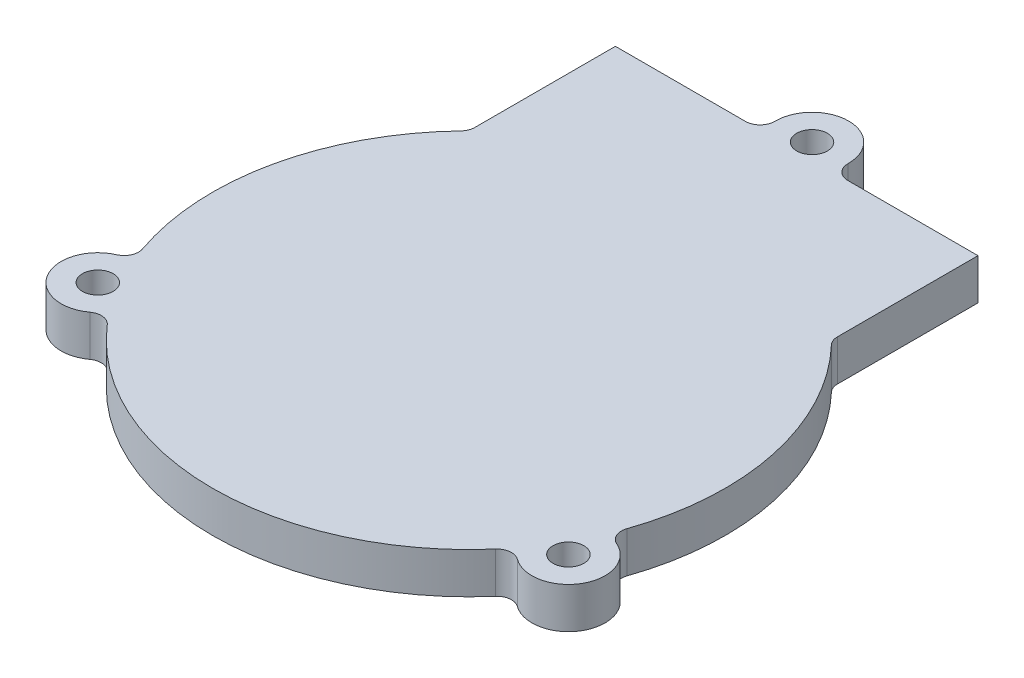
ISO-10303-21;
HEADER;
FILE_DESCRIPTION(('STEP AP214'),'2;1');
FILE_NAME('part.step','',(''),(''),'','','');
FILE_SCHEMA(('AUTOMOTIVE_DESIGN { 1 0 10303 214 1 1 1 1 }'));
ENDSEC;
DATA;
#1=APPLICATION_CONTEXT('core data for automotive mechanical design processes');
#2=APPLICATION_PROTOCOL_DEFINITION('international standard','automotive_design',2000,#1);
#3=PRODUCT_CONTEXT('',#1,'mechanical');
#4=PRODUCT('Part','Part','',(#3));
#5=PRODUCT_RELATED_PRODUCT_CATEGORY('part','',(#4));
#6=PRODUCT_DEFINITION_FORMATION('','',#4);
#7=PRODUCT_DEFINITION_CONTEXT('part definition',#1,'design');
#8=PRODUCT_DEFINITION('design','',#6,#7);
#9=PRODUCT_DEFINITION_SHAPE('','',#8);
#10=(LENGTH_UNIT() NAMED_UNIT(*) SI_UNIT(.MILLI.,.METRE.));
#11=(NAMED_UNIT(*) PLANE_ANGLE_UNIT() SI_UNIT($,.RADIAN.));
#12=(NAMED_UNIT(*) SI_UNIT($,.STERADIAN.) SOLID_ANGLE_UNIT());
#13=UNCERTAINTY_MEASURE_WITH_UNIT(LENGTH_MEASURE(1.E-05),#10,'distance_accuracy_value','');
#14=(GEOMETRIC_REPRESENTATION_CONTEXT(3) GLOBAL_UNCERTAINTY_ASSIGNED_CONTEXT((#13)) GLOBAL_UNIT_ASSIGNED_CONTEXT((#10,
#11,#12)) REPRESENTATION_CONTEXT('',''));
#15=CARTESIAN_POINT('',(0.,0.,0.));
#16=DIRECTION('',(0.,0.,1.));
#17=DIRECTION('',(1.,0.,0.));
#18=AXIS2_PLACEMENT_3D('',#15,#16,#17);
#19=CARTESIAN_POINT('',(0.,5.588,0.));
#20=DIRECTION('',(0.,-1.,0.));
#21=DIRECTION('',(0.,0.,-1.));
#22=AXIS2_PLACEMENT_3D('',#19,#20,#21);
#23=CYLINDRICAL_SURFACE('',#22,35.);
#24=CARTESIAN_POINT('',(0.,0.,0.));
#25=DIRECTION('',(0.,1.,0.));
#26=DIRECTION('',(0.,0.,1.));
#27=AXIS2_PLACEMENT_3D('',#24,#25,#26);
#28=CIRCLE('',#27,35.);
#29=CARTESIAN_POINT('',(-25.3019754085747,0.,-24.1828459951239));
#30=VERTEX_POINT('',#29);
#31=CARTESIAN_POINT('',(-33.072840065109,0.,11.4537002766671));
#32=VERTEX_POINT('',#31);
#33=EDGE_CURVE('E212',#30,#32,#28,.T.);
#34=ORIENTED_EDGE('',*,*,#33,.T.);
#35=DIRECTION('',(0.,-1.,0.));
#36=VECTOR('',#35,1.);
#37=CARTESIAN_POINT('',(-33.072840065109,5.588,11.4537002766671));
#38=LINE('',#37,#36);
#39=CARTESIAN_POINT('',(-33.072840065109,5.588,11.4537002766671));
#40=VERTEX_POINT('',#39);
#41=EDGE_CURVE('E225',#32,#40,#38,.F.);
#42=ORIENTED_EDGE('',*,*,#41,.T.);
#43=CARTESIAN_POINT('',(0.,5.588,0.));
#44=DIRECTION('',(0.,1.,0.));
#45=DIRECTION('',(0.,0.,1.));
#46=AXIS2_PLACEMENT_3D('',#43,#44,#45);
#47=CIRCLE('',#46,35.);
#48=CARTESIAN_POINT('',(-25.3019754085747,5.588,-24.1828459951239));
#49=VERTEX_POINT('',#48);
#50=EDGE_CURVE('E206',#49,#40,#47,.T.);
#51=ORIENTED_EDGE('',*,*,#50,.F.);
#52=DIRECTION('',(0.,-1.,0.));
#53=VECTOR('',#52,1.);
#54=CARTESIAN_POINT('',(-25.3019754085747,5.588,-24.1828459951239));
#55=LINE('',#54,#53);
#56=EDGE_CURVE('E219',#49,#30,#55,.T.);
#57=ORIENTED_EDGE('',*,*,#56,.T.);
#58=EDGE_LOOP('',(#34,#42,#51,#57));
#59=FACE_BOUND('',#58,.T.);
#60=ADVANCED_FACE('F43',(#59),#23,.T.);
#61=CARTESIAN_POINT('',(-26.5021889393046,0.,22.8611894140572));
#62=VERTEX_POINT('',#61);
#63=CARTESIAN_POINT('',(26.4887144081727,0.,22.8768006723464));
#64=VERTEX_POINT('',#63);
#65=EDGE_CURVE('E215',#62,#64,#28,.T.);
#66=ORIENTED_EDGE('',*,*,#65,.T.);
#67=DIRECTION('',(0.,-1.,0.));
#68=VECTOR('',#67,1.);
#69=CARTESIAN_POINT('',(26.4887144081727,5.588,22.8768006723464));
#70=LINE('',#69,#68);
#71=CARTESIAN_POINT('',(26.4887144081727,5.588,22.8768006723464));
#72=VERTEX_POINT('',#71);
#73=EDGE_CURVE('E244',#64,#72,#70,.F.);
#74=ORIENTED_EDGE('',*,*,#73,.T.);
#75=CARTESIAN_POINT('',(-26.5021889393046,5.588,22.8611894140572));
#76=VERTEX_POINT('',#75);
#77=EDGE_CURVE('E210',#76,#72,#47,.T.);
#78=ORIENTED_EDGE('',*,*,#77,.F.);
#79=DIRECTION('',(0.,-1.,0.));
#80=VECTOR('',#79,1.);
#81=CARTESIAN_POINT('',(-26.5021889393046,5.588,22.8611894140572));
#82=LINE('',#81,#80);
#83=EDGE_CURVE('E235',#76,#62,#82,.T.);
#84=ORIENTED_EDGE('',*,*,#83,.T.);
#85=EDGE_LOOP('',(#66,#74,#78,#84));
#86=FACE_BOUND('',#85,.T.);
#87=ADVANCED_FACE('F346',(#86),#23,.T.);
#88=CARTESIAN_POINT('',(-24.7478605121482,-53.381962685779,-44.7452325826062));
#89=DIRECTION('',(3.0206381024394E-06,0.,0.999999999995438));
#90=DIRECTION('',(0.999999999995438,0.,-3.0206381024394E-06));
#91=AXIS2_PLACEMENT_3D('',#88,#89,#90);
#92=PLANE('',#91);
#93=DIRECTION('',(0.999999999995438,0.,-3.0206381024394E-06));
#94=VECTOR('',#93,1.);
#95=CARTESIAN_POINT('',(-24.7478605121482,5.588,-44.7452325826062));
#96=LINE('',#95,#94);
#97=CARTESIAN_POINT('',(-24.7478605121482,5.588,-44.7452325826062));
#98=VERTEX_POINT('',#97);
#99=CARTESIAN_POINT('',(-6.99532394188785,5.588,-44.7452862065945));
#100=VERTEX_POINT('',#99);
#101=EDGE_CURVE('E178',#98,#100,#96,.T.);
#102=ORIENTED_EDGE('',*,*,#101,.T.);
#103=DIRECTION('',(0.,1.,0.));
#104=VECTOR('',#103,1.);
#105=CARTESIAN_POINT('',(-6.99532394188785,-53.381962685779,-44.7452862065945));
#106=LINE('',#105,#104);
#107=CARTESIAN_POINT('',(-6.99532394188785,0.,-44.7452862065945));
#108=VERTEX_POINT('',#107);
#109=EDGE_CURVE('E278',#100,#108,#106,.F.);
#110=ORIENTED_EDGE('',*,*,#109,.T.);
#111=DIRECTION('',(-0.999999999995438,0.,3.0206381024394E-06));
#112=VECTOR('',#111,1.);
#113=CARTESIAN_POINT('',(-24.7478605121482,0.,-44.7452325826062));
#114=LINE('',#113,#112);
#115=CARTESIAN_POINT('',(-24.7478605121482,0.,-44.7452325826062));
#116=VERTEX_POINT('',#115);
#117=EDGE_CURVE('E199',#108,#116,#114,.T.);
#118=ORIENTED_EDGE('',*,*,#117,.T.);
#119=DIRECTION('',(0.,1.,0.));
#120=VECTOR('',#119,1.);
#121=CARTESIAN_POINT('',(-24.7478605121482,-53.381962685779,-44.7452325826062));
#122=LINE('',#121,#120);
#123=EDGE_CURVE('E195',#116,#98,#122,.T.);
#124=ORIENTED_EDGE('',*,*,#123,.T.);
#125=EDGE_LOOP('',(#102,#110,#118,#124));
#126=FACE_BOUND('',#125,.T.);
#127=ADVANCED_FACE('F284',(#126),#92,.F.);
#128=CARTESIAN_POINT('',(33.0630730181294,0.,11.4818640733046));
#129=VERTEX_POINT('',#128);
#130=CARTESIAN_POINT('',(25.3018293128609,0.,-24.1829988509046));
#131=VERTEX_POINT('',#130);
#132=EDGE_CURVE('E216',#129,#131,#28,.T.);
#133=ORIENTED_EDGE('',*,*,#132,.T.);
#134=DIRECTION('',(0.,-1.,0.));
#135=VECTOR('',#134,1.);
#136=CARTESIAN_POINT('',(25.3018293128609,5.588,-24.1829988509046));
#137=LINE('',#136,#135);
#138=CARTESIAN_POINT('',(25.3018293128609,5.588,-24.1829988509046));
#139=VERTEX_POINT('',#138);
#140=EDGE_CURVE('E263',#131,#139,#137,.F.);
#141=ORIENTED_EDGE('',*,*,#140,.T.);
#142=CARTESIAN_POINT('',(33.0630730181294,5.588,11.4818640733046));
#143=VERTEX_POINT('',#142);
#144=EDGE_CURVE('E211',#143,#139,#47,.T.);
#145=ORIENTED_EDGE('',*,*,#144,.F.);
#146=DIRECTION('',(0.,-1.,0.));
#147=VECTOR('',#146,1.);
#148=CARTESIAN_POINT('',(33.0630730181294,5.588,11.4818640733046));
#149=LINE('',#148,#147);
#150=EDGE_CURVE('E254',#143,#129,#149,.T.);
#151=ORIENTED_EDGE('',*,*,#150,.T.);
#152=EDGE_LOOP('',(#133,#141,#145,#151));
#153=FACE_BOUND('',#152,.T.);
#154=ADVANCED_FACE('F336',(#153),#23,.T.);
#155=CARTESIAN_POINT('',(0.,5.588,0.));
#156=DIRECTION('',(0.,1.,0.));
#157=DIRECTION('',(0.,0.,1.));
#158=AXIS2_PLACEMENT_3D('',#155,#156,#157);
#159=PLANE('',#158);
#160=CARTESIAN_POINT('',(-32.1480166138315,5.588,18.5087961651664));
#161=DIRECTION('',(0.,1.,0.));
#162=DIRECTION('',(0.,0.,1.));
#163=AXIS2_PLACEMENT_3D('',#160,#161,#162);
#164=CIRCLE('',#163,2.09999999999999);
#165=CARTESIAN_POINT('',(-32.1480166138315,5.588,20.6087961651664));
#166=VERTEX_POINT('',#165);
#167=EDGE_CURVE('E329',#166,#166,#164,.T.);
#168=ORIENTED_EDGE('',*,*,#167,.F.);
#169=EDGE_LOOP('',(#168));
#170=FACE_BOUND('',#169,.T.);
#171=DIRECTION('',(-3.02063810260161E-06,0.,-0.999999999995438));
#172=VECTOR('',#171,1.);
#173=CARTESIAN_POINT('',(-24.7478001128037,5.588,-24.7496745347634));
#174=LINE('',#173,#172);
#175=CARTESIAN_POINT('',(-24.7478025747881,5.588,-25.5647289504072));
#176=VERTEX_POINT('',#175);
#177=EDGE_CURVE('E196',#176,#98,#174,.T.);
#178=ORIENTED_EDGE('',*,*,#177,.F.);
#179=CARTESIAN_POINT('',(-26.747802574779,5.588,-25.564722909131));
#180=DIRECTION('',(0.,1.,0.));
#181=DIRECTION('',(0.,0.,1.));
#182=AXIS2_PLACEMENT_3D('',#179,#180,#181);
#183=CIRCLE('',#182,2.);
#184=EDGE_CURVE('E221',#176,#49,#183,.F.);
#185=ORIENTED_EDGE('',*,*,#184,.T.);
#186=ORIENTED_EDGE('',*,*,#50,.T.);
#187=CARTESIAN_POINT('',(-34.9627166402581,5.588,12.1081974353338));
#188=DIRECTION('',(0.,1.,0.));
#189=DIRECTION('',(0.,0.,1.));
#190=AXIS2_PLACEMENT_3D('',#187,#188,#189);
#191=CIRCLE('',#190,2.);
#192=CARTESIAN_POINT('',(-34.1580179965192,5.588,13.9391698799011));
#193=VERTEX_POINT('',#192);
#194=EDGE_CURVE('E231',#40,#193,#191,.F.);
#195=ORIENTED_EDGE('',*,*,#194,.T.);
#196=CARTESIAN_POINT('',(-32.1464555555357,5.588,18.5161819435163));
#197=DIRECTION('',(0.,1.,0.));
#198=DIRECTION('',(0.,0.,1.));
#199=AXIS2_PLACEMENT_3D('',#196,#197,#198);
#200=CIRCLE('',#199,4.99954226749351);
#201=CARTESIAN_POINT('',(-29.1966357044392,5.588,22.5527628891349));
#202=VERTEX_POINT('',#201);
#203=EDGE_CURVE('E323',#193,#202,#200,.T.);
#204=ORIENTED_EDGE('',*,*,#203,.T.);
#205=CARTESIAN_POINT('',(-28.0165997358363,5.588,24.1675430948605));
#206=DIRECTION('',(0.,1.,0.));
#207=DIRECTION('',(0.,0.,1.));
#208=AXIS2_PLACEMENT_3D('',#205,#206,#207);
#209=CIRCLE('',#208,2.);
#210=EDGE_CURVE('E242',#202,#76,#209,.F.);
#211=ORIENTED_EDGE('',*,*,#210,.T.);
#212=ORIENTED_EDGE('',*,*,#77,.T.);
#213=CARTESIAN_POINT('',(28.0023552314968,5.588,24.1840464250519));
#214=DIRECTION('',(0.,1.,0.));
#215=DIRECTION('',(0.,0.,1.));
#216=AXIS2_PLACEMENT_3D('',#213,#214,#215);
#217=CIRCLE('',#216,2.);
#218=CARTESIAN_POINT('',(29.184359284545,5.588,22.5707062815676));
#219=VERTEX_POINT('',#218);
#220=EDGE_CURVE('E250',#72,#219,#217,.F.);
#221=ORIENTED_EDGE('',*,*,#220,.T.);
#222=CARTESIAN_POINT('',(32.1364886347761,5.588,18.5412879583363));
#223=DIRECTION('',(0.,1.,0.));
#224=DIRECTION('',(0.,0.,1.));
#225=AXIS2_PLACEMENT_3D('',#222,#223,#224);
#226=CIRCLE('',#225,4.9951255964279);
#227=CARTESIAN_POINT('',(34.147287178261,5.588,13.9687647007018));
#228=VERTEX_POINT('',#227);
#229=EDGE_CURVE('E312',#219,#228,#226,.T.);
#230=ORIENTED_EDGE('',*,*,#229,.T.);
#231=CARTESIAN_POINT('',(34.9523914763083,5.588,12.1379705917791));
#232=DIRECTION('',(0.,1.,0.));
#233=DIRECTION('',(0.,0.,1.));
#234=AXIS2_PLACEMENT_3D('',#231,#232,#233);
#235=CIRCLE('',#234,2.);
#236=EDGE_CURVE('E261',#228,#143,#235,.F.);
#237=ORIENTED_EDGE('',*,*,#236,.T.);
#238=ORIENTED_EDGE('',*,*,#144,.T.);
#239=CARTESIAN_POINT('',(26.7476481307387,5.588,-25.5648844995277));
#240=DIRECTION('',(0.,1.,0.));
#241=DIRECTION('',(0.,0.,1.));
#242=AXIS2_PLACEMENT_3D('',#239,#240,#241);
#243=CIRCLE('',#242,2.);
#244=CARTESIAN_POINT('',(24.7476481307478,5.588,-25.5648784582515));
#245=VERTEX_POINT('',#244);
#246=EDGE_CURVE('E186',#139,#245,#243,.F.);
#247=ORIENTED_EDGE('',*,*,#246,.T.);
#248=DIRECTION('',(-3.02063810260161E-06,0.,-0.999999999995438));
#249=VECTOR('',#248,1.);
#250=CARTESIAN_POINT('',(24.7476505927322,5.588,-24.7498240426077));
#251=LINE('',#250,#249);
#252=CARTESIAN_POINT('',(24.7475901933877,5.588,-44.7453820904505));
#253=VERTEX_POINT('',#252);
#254=EDGE_CURVE('E179',#245,#253,#251,.T.);
#255=ORIENTED_EDGE('',*,*,#254,.T.);
#256=CARTESIAN_POINT('',(6.99533660471705,5.588,-44.7453284673169));
#257=VERTEX_POINT('',#256);
#258=EDGE_CURVE('E169',#257,#253,#96,.T.);
#259=ORIENTED_EDGE('',*,*,#258,.F.);
#260=CARTESIAN_POINT('',(6.99533056344084,5.588,-46.7453284673078));
#261=DIRECTION('',(0.,1.,0.));
#262=DIRECTION('',(0.,0.,1.));
#263=AXIS2_PLACEMENT_3D('',#260,#261,#262);
#264=CIRCLE('',#263,2.);
#265=CARTESIAN_POINT('',(4.99551899083441,5.588,-46.7727815922561));
#266=VERTEX_POINT('',#265);
#267=EDGE_CURVE('E274',#257,#266,#264,.F.);
#268=ORIENTED_EDGE('',*,*,#267,.T.);
#269=CARTESIAN_POINT('',(0.,5.588,-46.8413593567393));
#270=DIRECTION('',(0.,1.,0.));
#271=DIRECTION('',(0.,0.,1.));
#272=AXIS2_PLACEMENT_3D('',#269,#270,#271);
#273=CIRCLE('',#272,4.99598968149142);
#274=CARTESIAN_POINT('',(-4.99551857644603,5.588,-46.7727514129473));
#275=VERTEX_POINT('',#274);
#276=EDGE_CURVE('E301',#266,#275,#273,.T.);
#277=ORIENTED_EDGE('',*,*,#276,.T.);
#278=CARTESIAN_POINT('',(-6.99532998316405,5.588,-46.7452862065854));
#279=DIRECTION('',(0.,1.,0.));
#280=DIRECTION('',(0.,0.,1.));
#281=AXIS2_PLACEMENT_3D('',#278,#279,#280);
#282=CIRCLE('',#281,2.);
#283=EDGE_CURVE('E12',#275,#100,#282,.F.);
#284=ORIENTED_EDGE('',*,*,#283,.T.);
#285=ORIENTED_EDGE('',*,*,#101,.F.);
#286=EDGE_LOOP('',(#178,#185,#186,#195,#204,#211,#212,#221,#230,#237,#238,#247,#255,#259,#268,
#277,#284,#285));
#287=FACE_BOUND('',#286,.T.);
#288=CARTESIAN_POINT('',(32.1247811991366,5.588,18.5356173256723));
#289=DIRECTION('',(0.,1.,0.));
#290=DIRECTION('',(0.,0.,1.));
#291=AXIS2_PLACEMENT_3D('',#288,#289,#290);
#292=CIRCLE('',#291,2.1);
#293=CARTESIAN_POINT('',(32.1247811991366,5.588,20.6356173256723));
#294=VERTEX_POINT('',#293);
#295=EDGE_CURVE('E318',#294,#294,#292,.T.);
#296=ORIENTED_EDGE('',*,*,#295,.F.);
#297=EDGE_LOOP('',(#296));
#298=FACE_BOUND('',#297,.T.);
#299=CARTESIAN_POINT('',(0.,5.588,-46.8413593567393));
#300=DIRECTION('',(0.,1.,0.));
#301=DIRECTION('',(0.,0.,1.));
#302=AXIS2_PLACEMENT_3D('',#299,#300,#301);
#303=CIRCLE('',#302,2.09605202456873);
#304=CARTESIAN_POINT('',(0.,5.588,-44.7453073321706));
#305=VERTEX_POINT('',#304);
#306=EDGE_CURVE('E305',#305,#305,#303,.T.);
#307=ORIENTED_EDGE('',*,*,#306,.F.);
#308=EDGE_LOOP('',(#307));
#309=FACE_BOUND('',#308,.T.);
#310=ADVANCED_FACE('F183',(#170,#287,#298,#309),#159,.T.);
#311=CARTESIAN_POINT('',(0.,0.,0.));
#312=DIRECTION('',(0.,1.,0.));
#313=DIRECTION('',(0.,0.,1.));
#314=AXIS2_PLACEMENT_3D('',#311,#312,#313);
#315=PLANE('',#314);
#316=CARTESIAN_POINT('',(-32.1480166138315,0.,18.5087961651664));
#317=DIRECTION('',(0.,1.,0.));
#318=DIRECTION('',(0.,0.,1.));
#319=AXIS2_PLACEMENT_3D('',#316,#317,#318);
#320=CIRCLE('',#319,2.1);
#321=CARTESIAN_POINT('',(-32.1480166138315,0.,20.6087961651664));
#322=VERTEX_POINT('',#321);
#323=EDGE_CURVE('E326',#322,#322,#320,.T.);
#324=ORIENTED_EDGE('',*,*,#323,.T.);
#325=EDGE_LOOP('',(#324));
#326=FACE_BOUND('',#325,.T.);
#327=CARTESIAN_POINT('',(32.1247811991366,0.,18.5356173256723));
#328=DIRECTION('',(0.,1.,0.));
#329=DIRECTION('',(0.,0.,1.));
#330=AXIS2_PLACEMENT_3D('',#327,#328,#329);
#331=CIRCLE('',#330,2.1);
#332=CARTESIAN_POINT('',(32.1247811991366,0.,20.6356173256723));
#333=VERTEX_POINT('',#332);
#334=EDGE_CURVE('E315',#333,#333,#331,.T.);
#335=ORIENTED_EDGE('',*,*,#334,.T.);
#336=EDGE_LOOP('',(#335));
#337=FACE_BOUND('',#336,.T.);
#338=CARTESIAN_POINT('',(0.,0.,-46.8413593567393));
#339=DIRECTION('',(0.,1.,0.));
#340=DIRECTION('',(0.,0.,1.));
#341=AXIS2_PLACEMENT_3D('',#338,#339,#340);
#342=CIRCLE('',#341,2.09605202456873);
#343=CARTESIAN_POINT('',(0.,0.,-44.7453073321706));
#344=VERTEX_POINT('',#343);
#345=EDGE_CURVE('E303',#344,#344,#342,.T.);
#346=ORIENTED_EDGE('',*,*,#345,.T.);
#347=EDGE_LOOP('',(#346));
#348=FACE_BOUND('',#347,.T.);
#349=ORIENTED_EDGE('',*,*,#65,.F.);
#350=CARTESIAN_POINT('',(-28.0165997358363,0.,24.1675430948605));
#351=DIRECTION('',(0.,1.,0.));
#352=DIRECTION('',(0.,0.,1.));
#353=AXIS2_PLACEMENT_3D('',#350,#351,#352);
#354=CIRCLE('',#353,2.);
#355=CARTESIAN_POINT('',(-29.1966357044392,0.,22.5527628891349));
#356=VERTEX_POINT('',#355);
#357=EDGE_CURVE('E240',#62,#356,#354,.T.);
#358=ORIENTED_EDGE('',*,*,#357,.T.);
#359=CARTESIAN_POINT('',(-32.1464555555357,0.,18.5161819435163));
#360=DIRECTION('',(0.,1.,0.));
#361=DIRECTION('',(0.,0.,1.));
#362=AXIS2_PLACEMENT_3D('',#359,#360,#361);
#363=CIRCLE('',#362,4.99954226749351);
#364=CARTESIAN_POINT('',(-34.1580179965192,0.,13.9391698799011));
#365=VERTEX_POINT('',#364);
#366=EDGE_CURVE('E321',#356,#365,#363,.F.);
#367=ORIENTED_EDGE('',*,*,#366,.T.);
#368=CARTESIAN_POINT('',(-34.9627166402581,0.,12.1081974353338));
#369=DIRECTION('',(0.,1.,0.));
#370=DIRECTION('',(0.,0.,1.));
#371=AXIS2_PLACEMENT_3D('',#368,#369,#370);
#372=CIRCLE('',#371,2.);
#373=EDGE_CURVE('E233',#365,#32,#372,.T.);
#374=ORIENTED_EDGE('',*,*,#373,.T.);
#375=ORIENTED_EDGE('',*,*,#33,.F.);
#376=CARTESIAN_POINT('',(-26.747802574779,0.,-25.564722909131));
#377=DIRECTION('',(0.,1.,0.));
#378=DIRECTION('',(0.,0.,1.));
#379=AXIS2_PLACEMENT_3D('',#376,#377,#378);
#380=CIRCLE('',#379,2.);
#381=CARTESIAN_POINT('',(-24.7478025747881,0.,-25.5647289504072));
#382=VERTEX_POINT('',#381);
#383=EDGE_CURVE('E223',#30,#382,#380,.T.);
#384=ORIENTED_EDGE('',*,*,#383,.T.);
#385=DIRECTION('',(3.02063810260161E-06,0.,0.999999999995438));
#386=VECTOR('',#385,1.);
#387=CARTESIAN_POINT('',(-24.7478001128037,0.,-24.7496745347634));
#388=LINE('',#387,#386);
#389=EDGE_CURVE('E205',#116,#382,#388,.T.);
#390=ORIENTED_EDGE('',*,*,#389,.F.);
#391=ORIENTED_EDGE('',*,*,#117,.F.);
#392=CARTESIAN_POINT('',(-6.99532998316405,0.,-46.7452862065854));
#393=DIRECTION('',(0.,1.,0.));
#394=DIRECTION('',(0.,0.,1.));
#395=AXIS2_PLACEMENT_3D('',#392,#393,#394);
#396=CIRCLE('',#395,2.);
#397=CARTESIAN_POINT('',(-4.99551857644603,0.,-46.7727514129473));
#398=VERTEX_POINT('',#397);
#399=EDGE_CURVE('E51',#108,#398,#396,.T.);
#400=ORIENTED_EDGE('',*,*,#399,.T.);
#401=CARTESIAN_POINT('',(0.,0.,-46.8413593567393));
#402=DIRECTION('',(0.,1.,0.));
#403=DIRECTION('',(0.,0.,1.));
#404=AXIS2_PLACEMENT_3D('',#401,#402,#403);
#405=CIRCLE('',#404,4.99598968149142);
#406=CARTESIAN_POINT('',(4.99551899083441,0.,-46.7727815922561));
#407=VERTEX_POINT('',#406);
#408=EDGE_CURVE('E189',#407,#398,#405,.T.);
#409=ORIENTED_EDGE('',*,*,#408,.F.);
#410=CARTESIAN_POINT('',(6.99533056344084,0.,-46.7453284673078));
#411=DIRECTION('',(0.,1.,0.));
#412=DIRECTION('',(0.,0.,1.));
#413=AXIS2_PLACEMENT_3D('',#410,#411,#412);
#414=CIRCLE('',#413,2.);
#415=CARTESIAN_POINT('',(6.99533660471705,0.,-44.7453284673169));
#416=VERTEX_POINT('',#415);
#417=EDGE_CURVE('E276',#407,#416,#414,.T.);
#418=ORIENTED_EDGE('',*,*,#417,.T.);
#419=CARTESIAN_POINT('',(24.7475901933877,0.,-44.7453820904505));
#420=VERTEX_POINT('',#419);
#421=EDGE_CURVE('E203',#420,#416,#114,.T.);
#422=ORIENTED_EDGE('',*,*,#421,.F.);
#423=DIRECTION('',(3.02063810260161E-06,0.,0.999999999995438));
#424=VECTOR('',#423,1.);
#425=CARTESIAN_POINT('',(24.7476505927322,0.,-24.7498240426077));
#426=LINE('',#425,#424);
#427=CARTESIAN_POINT('',(24.7476481307478,0.,-25.5648784582515));
#428=VERTEX_POINT('',#427);
#429=EDGE_CURVE('E194',#420,#428,#426,.T.);
#430=ORIENTED_EDGE('',*,*,#429,.T.);
#431=CARTESIAN_POINT('',(26.7476481307387,0.,-25.5648844995277));
#432=DIRECTION('',(0.,1.,0.));
#433=DIRECTION('',(0.,0.,1.));
#434=AXIS2_PLACEMENT_3D('',#431,#432,#433);
#435=CIRCLE('',#434,2.);
#436=EDGE_CURVE('E269',#428,#131,#435,.T.);
#437=ORIENTED_EDGE('',*,*,#436,.T.);
#438=ORIENTED_EDGE('',*,*,#132,.F.);
#439=CARTESIAN_POINT('',(34.9523914763083,0.,12.1379705917791));
#440=DIRECTION('',(0.,1.,0.));
#441=DIRECTION('',(0.,0.,1.));
#442=AXIS2_PLACEMENT_3D('',#439,#440,#441);
#443=CIRCLE('',#442,2.);
#444=CARTESIAN_POINT('',(34.147287178261,0.,13.9687647007018));
#445=VERTEX_POINT('',#444);
#446=EDGE_CURVE('E259',#129,#445,#443,.T.);
#447=ORIENTED_EDGE('',*,*,#446,.T.);
#448=CARTESIAN_POINT('',(32.1364886347761,0.,18.5412879583363));
#449=DIRECTION('',(0.,1.,0.));
#450=DIRECTION('',(0.,0.,1.));
#451=AXIS2_PLACEMENT_3D('',#448,#449,#450);
#452=CIRCLE('',#451,4.9951255964279);
#453=CARTESIAN_POINT('',(29.184359284545,0.,22.5707062815676));
#454=VERTEX_POINT('',#453);
#455=EDGE_CURVE('E308',#445,#454,#452,.F.);
#456=ORIENTED_EDGE('',*,*,#455,.T.);
#457=CARTESIAN_POINT('',(28.0023552314968,0.,24.1840464250519));
#458=DIRECTION('',(0.,1.,0.));
#459=DIRECTION('',(0.,0.,1.));
#460=AXIS2_PLACEMENT_3D('',#457,#458,#459);
#461=CIRCLE('',#460,2.);
#462=EDGE_CURVE('E252',#454,#64,#461,.T.);
#463=ORIENTED_EDGE('',*,*,#462,.T.);
#464=EDGE_LOOP('',(#349,#358,#367,#374,#375,#384,#390,#391,#400,#409,#418,#422,#430,#437,#438,
#447,#456,#463));
#465=FACE_BOUND('',#464,.T.);
#466=ADVANCED_FACE('F290',(#326,#337,#348,#465),#315,.F.);
#467=ORIENTED_EDGE('',*,*,#421,.T.);
#468=DIRECTION('',(0.,1.,0.));
#469=VECTOR('',#468,1.);
#470=CARTESIAN_POINT('',(6.99533660471704,-53.381962685779,-44.7453284673169));
#471=LINE('',#470,#469);
#472=EDGE_CURVE('E176',#416,#257,#471,.T.);
#473=ORIENTED_EDGE('',*,*,#472,.T.);
#474=ORIENTED_EDGE('',*,*,#258,.T.);
#475=DIRECTION('',(0.,1.,0.));
#476=VECTOR('',#475,1.);
#477=CARTESIAN_POINT('',(24.7475901933877,-53.381962685779,-44.7453820904505));
#478=LINE('',#477,#476);
#479=EDGE_CURVE('E174',#420,#253,#478,.T.);
#480=ORIENTED_EDGE('',*,*,#479,.F.);
#481=EDGE_LOOP('',(#467,#473,#474,#480));
#482=FACE_BOUND('',#481,.T.);
#483=ADVANCED_FACE('F172',(#482),#92,.F.);
#484=CARTESIAN_POINT('',(-24.7478001128037,-53.381962685779,-24.7496745347634));
#485=DIRECTION('',(0.999999999995438,0.,-3.02063810260161E-06));
#486=DIRECTION('',(-3.02063810260161E-06,0.,-0.999999999995438));
#487=AXIS2_PLACEMENT_3D('',#484,#485,#486);
#488=PLANE('',#487);
#489=ORIENTED_EDGE('',*,*,#389,.T.);
#490=DIRECTION('',(0.,1.,0.));
#491=VECTOR('',#490,1.);
#492=CARTESIAN_POINT('',(-24.7478025747881,5.588,-25.5647289504072));
#493=LINE('',#492,#491);
#494=EDGE_CURVE('E209',#382,#176,#493,.T.);
#495=ORIENTED_EDGE('',*,*,#494,.T.);
#496=ORIENTED_EDGE('',*,*,#177,.T.);
#497=ORIENTED_EDGE('',*,*,#123,.F.);
#498=EDGE_LOOP('',(#489,#495,#496,#497));
#499=FACE_BOUND('',#498,.T.);
#500=ADVANCED_FACE('F298',(#499),#488,.F.);
#501=CARTESIAN_POINT('',(24.7476505927322,-53.381962685779,-24.7498240426077));
#502=DIRECTION('',(0.999999999995438,0.,-3.02063810260161E-06));
#503=DIRECTION('',(-3.02063810260161E-06,0.,-0.999999999995438));
#504=AXIS2_PLACEMENT_3D('',#501,#502,#503);
#505=PLANE('',#504);
#506=ORIENTED_EDGE('',*,*,#254,.F.);
#507=DIRECTION('',(0.,-1.,0.));
#508=VECTOR('',#507,1.);
#509=CARTESIAN_POINT('',(24.7476481307478,-53.381962685779,-25.5648784582515));
#510=LINE('',#509,#508);
#511=EDGE_CURVE('E266',#245,#428,#510,.T.);
#512=ORIENTED_EDGE('',*,*,#511,.T.);
#513=ORIENTED_EDGE('',*,*,#429,.F.);
#514=ORIENTED_EDGE('',*,*,#479,.T.);
#515=EDGE_LOOP('',(#506,#512,#513,#514));
#516=FACE_BOUND('',#515,.T.);
#517=ADVANCED_FACE('F192',(#516),#505,.T.);
#518=CARTESIAN_POINT('',(0.,0.,-46.8413593567393));
#519=DIRECTION('',(0.,1.,0.));
#520=DIRECTION('',(0.,0.,1.));
#521=AXIS2_PLACEMENT_3D('',#518,#519,#520);
#522=CYLINDRICAL_SURFACE('',#521,4.99598968149142);
#523=ORIENTED_EDGE('',*,*,#408,.T.);
#524=DIRECTION('',(0.,1.,0.));
#525=VECTOR('',#524,1.);
#526=CARTESIAN_POINT('',(-4.99551857644604,0.,-46.7727514129473));
#527=LINE('',#526,#525);
#528=EDGE_CURVE('E64',#398,#275,#527,.T.);
#529=ORIENTED_EDGE('',*,*,#528,.T.);
#530=ORIENTED_EDGE('',*,*,#276,.F.);
#531=DIRECTION('',(0.,1.,0.));
#532=VECTOR('',#531,1.);
#533=CARTESIAN_POINT('',(4.99551899083441,0.,-46.7727815922561));
#534=LINE('',#533,#532);
#535=EDGE_CURVE('E272',#266,#407,#534,.F.);
#536=ORIENTED_EDGE('',*,*,#535,.T.);
#537=EDGE_LOOP('',(#523,#529,#530,#536));
#538=FACE_BOUND('',#537,.T.);
#539=ADVANCED_FACE('F386',(#538),#522,.T.);
#540=CARTESIAN_POINT('',(0.,0.,-46.8413593567393));
#541=DIRECTION('',(0.,1.,0.));
#542=DIRECTION('',(0.,0.,1.));
#543=AXIS2_PLACEMENT_3D('',#540,#541,#542);
#544=CYLINDRICAL_SURFACE('',#543,2.09605202456873);
#545=ORIENTED_EDGE('',*,*,#306,.T.);
#546=EDGE_LOOP('',(#545));
#547=FACE_BOUND('',#546,.T.);
#548=ORIENTED_EDGE('',*,*,#345,.F.);
#549=EDGE_LOOP('',(#548));
#550=FACE_BOUND('',#549,.T.);
#551=ADVANCED_FACE('F388',(#547,#550),#544,.F.);
#552=CARTESIAN_POINT('',(32.1364886347761,-14.1283487284507,18.5412879583363));
#553=DIRECTION('',(0.,1.,0.));
#554=DIRECTION('',(0.,0.,1.));
#555=AXIS2_PLACEMENT_3D('',#552,#553,#554);
#556=CYLINDRICAL_SURFACE('',#555,4.9951255964279);
#557=ORIENTED_EDGE('',*,*,#455,.F.);
#558=DIRECTION('',(0.,1.,0.));
#559=VECTOR('',#558,1.);
#560=CARTESIAN_POINT('',(34.147287178261,-14.1283487284507,13.9687647007018));
#561=LINE('',#560,#559);
#562=EDGE_CURVE('E257',#445,#228,#561,.T.);
#563=ORIENTED_EDGE('',*,*,#562,.T.);
#564=ORIENTED_EDGE('',*,*,#229,.F.);
#565=DIRECTION('',(0.,1.,0.));
#566=VECTOR('',#565,1.);
#567=CARTESIAN_POINT('',(29.184359284545,-14.1283487284507,22.5707062815676));
#568=LINE('',#567,#566);
#569=EDGE_CURVE('E247',#219,#454,#568,.F.);
#570=ORIENTED_EDGE('',*,*,#569,.T.);
#571=EDGE_LOOP('',(#557,#563,#564,#570));
#572=FACE_BOUND('',#571,.T.);
#573=ADVANCED_FACE('F394',(#572),#556,.T.);
#574=CARTESIAN_POINT('',(32.1247811991366,5.588,18.5356173256723));
#575=DIRECTION('',(0.,1.,0.));
#576=DIRECTION('',(0.,0.,1.));
#577=AXIS2_PLACEMENT_3D('',#574,#575,#576);
#578=CYLINDRICAL_SURFACE('',#577,2.1);
#579=ORIENTED_EDGE('',*,*,#334,.F.);
#580=EDGE_LOOP('',(#579));
#581=FACE_BOUND('',#580,.T.);
#582=ORIENTED_EDGE('',*,*,#295,.T.);
#583=EDGE_LOOP('',(#582));
#584=FACE_BOUND('',#583,.T.);
#585=ADVANCED_FACE('F480',(#581,#584),#578,.F.);
#586=CARTESIAN_POINT('',(-32.1464555555357,-14.1408409606937,18.5161819435163));
#587=DIRECTION('',(0.,1.,0.));
#588=DIRECTION('',(0.,0.,1.));
#589=AXIS2_PLACEMENT_3D('',#586,#587,#588);
#590=CYLINDRICAL_SURFACE('',#589,4.99954226749351);
#591=ORIENTED_EDGE('',*,*,#366,.F.);
#592=DIRECTION('',(0.,1.,0.));
#593=VECTOR('',#592,1.);
#594=CARTESIAN_POINT('',(-29.1966357044392,-14.1408409606937,22.5527628891349));
#595=LINE('',#594,#593);
#596=EDGE_CURVE('E238',#356,#202,#595,.T.);
#597=ORIENTED_EDGE('',*,*,#596,.T.);
#598=ORIENTED_EDGE('',*,*,#203,.F.);
#599=DIRECTION('',(0.,1.,0.));
#600=VECTOR('',#599,1.);
#601=CARTESIAN_POINT('',(-34.1580179965192,-14.1408409606937,13.9391698799011));
#602=LINE('',#601,#600);
#603=EDGE_CURVE('E228',#193,#365,#602,.F.);
#604=ORIENTED_EDGE('',*,*,#603,.T.);
#605=EDGE_LOOP('',(#591,#597,#598,#604));
#606=FACE_BOUND('',#605,.T.);
#607=ADVANCED_FACE('F486',(#606),#590,.T.);
#608=CARTESIAN_POINT('',(-32.1480166138315,5.588,18.5087961651664));
#609=DIRECTION('',(0.,1.,0.));
#610=DIRECTION('',(0.,0.,1.));
#611=AXIS2_PLACEMENT_3D('',#608,#609,#610);
#612=CYLINDRICAL_SURFACE('',#611,2.09999999999999);
#613=ORIENTED_EDGE('',*,*,#323,.F.);
#614=EDGE_LOOP('',(#613));
#615=FACE_BOUND('',#614,.T.);
#616=ORIENTED_EDGE('',*,*,#167,.T.);
#617=EDGE_LOOP('',(#616));
#618=FACE_BOUND('',#617,.T.);
#619=ADVANCED_FACE('F333',(#615,#618),#612,.F.);
#620=CARTESIAN_POINT('',(-26.747802574779,5.588,-25.564722909131));
#621=DIRECTION('',(0.,-1.,0.));
#622=DIRECTION('',(0.,0.,-1.));
#623=AXIS2_PLACEMENT_3D('',#620,#621,#622);
#624=CYLINDRICAL_SURFACE('',#623,2.);
#625=ORIENTED_EDGE('',*,*,#383,.F.);
#626=ORIENTED_EDGE('',*,*,#56,.F.);
#627=ORIENTED_EDGE('',*,*,#184,.F.);
#628=ORIENTED_EDGE('',*,*,#494,.F.);
#629=EDGE_LOOP('',(#625,#626,#627,#628));
#630=FACE_BOUND('',#629,.T.);
#631=ADVANCED_FACE('F355',(#630),#624,.F.);
#632=CARTESIAN_POINT('',(-34.9627166402581,-14.1408409606937,12.1081974353338));
#633=DIRECTION('',(0.,-1.,0.));
#634=DIRECTION('',(0.,0.,-1.));
#635=AXIS2_PLACEMENT_3D('',#632,#633,#634);
#636=CYLINDRICAL_SURFACE('',#635,2.);
#637=ORIENTED_EDGE('',*,*,#373,.F.);
#638=ORIENTED_EDGE('',*,*,#603,.F.);
#639=ORIENTED_EDGE('',*,*,#194,.F.);
#640=ORIENTED_EDGE('',*,*,#41,.F.);
#641=EDGE_LOOP('',(#637,#638,#639,#640));
#642=FACE_BOUND('',#641,.T.);
#643=ADVANCED_FACE('F358',(#642),#636,.F.);
#644=CARTESIAN_POINT('',(-28.0165997358363,-14.1408409606937,24.1675430948605));
#645=DIRECTION('',(0.,1.,0.));
#646=DIRECTION('',(0.,0.,1.));
#647=AXIS2_PLACEMENT_3D('',#644,#645,#646);
#648=CYLINDRICAL_SURFACE('',#647,2.);
#649=ORIENTED_EDGE('',*,*,#210,.F.);
#650=ORIENTED_EDGE('',*,*,#596,.F.);
#651=ORIENTED_EDGE('',*,*,#357,.F.);
#652=ORIENTED_EDGE('',*,*,#83,.F.);
#653=EDGE_LOOP('',(#649,#650,#651,#652));
#654=FACE_BOUND('',#653,.T.);
#655=ADVANCED_FACE('F362',(#654),#648,.F.);
#656=CARTESIAN_POINT('',(28.0023552314968,-14.1283487284507,24.1840464250519));
#657=DIRECTION('',(0.,-1.,0.));
#658=DIRECTION('',(0.,0.,-1.));
#659=AXIS2_PLACEMENT_3D('',#656,#657,#658);
#660=CYLINDRICAL_SURFACE('',#659,2.);
#661=ORIENTED_EDGE('',*,*,#462,.F.);
#662=ORIENTED_EDGE('',*,*,#569,.F.);
#663=ORIENTED_EDGE('',*,*,#220,.F.);
#664=ORIENTED_EDGE('',*,*,#73,.F.);
#665=EDGE_LOOP('',(#661,#662,#663,#664));
#666=FACE_BOUND('',#665,.T.);
#667=ADVANCED_FACE('F366',(#666),#660,.F.);
#668=CARTESIAN_POINT('',(34.9523914763083,-14.1283487284507,12.1379705917791));
#669=DIRECTION('',(0.,1.,0.));
#670=DIRECTION('',(0.,0.,1.));
#671=AXIS2_PLACEMENT_3D('',#668,#669,#670);
#672=CYLINDRICAL_SURFACE('',#671,2.);
#673=ORIENTED_EDGE('',*,*,#236,.F.);
#674=ORIENTED_EDGE('',*,*,#562,.F.);
#675=ORIENTED_EDGE('',*,*,#446,.F.);
#676=ORIENTED_EDGE('',*,*,#150,.F.);
#677=EDGE_LOOP('',(#673,#674,#675,#676));
#678=FACE_BOUND('',#677,.T.);
#679=ADVANCED_FACE('F370',(#678),#672,.F.);
#680=CARTESIAN_POINT('',(26.7476481307387,5.588,-25.5648844995277));
#681=DIRECTION('',(0.,-1.,0.));
#682=DIRECTION('',(0.,0.,-1.));
#683=AXIS2_PLACEMENT_3D('',#680,#681,#682);
#684=CYLINDRICAL_SURFACE('',#683,2.);
#685=ORIENTED_EDGE('',*,*,#436,.F.);
#686=ORIENTED_EDGE('',*,*,#511,.F.);
#687=ORIENTED_EDGE('',*,*,#246,.F.);
#688=ORIENTED_EDGE('',*,*,#140,.F.);
#689=EDGE_LOOP('',(#685,#686,#687,#688));
#690=FACE_BOUND('',#689,.T.);
#691=ADVANCED_FACE('F374',(#690),#684,.F.);
#692=CARTESIAN_POINT('',(6.99533056344084,0.,-46.7453284673078));
#693=DIRECTION('',(0.,1.,0.));
#694=DIRECTION('',(0.,0.,1.));
#695=AXIS2_PLACEMENT_3D('',#692,#693,#694);
#696=CYLINDRICAL_SURFACE('',#695,2.);
#697=ORIENTED_EDGE('',*,*,#417,.F.);
#698=ORIENTED_EDGE('',*,*,#535,.F.);
#699=ORIENTED_EDGE('',*,*,#267,.F.);
#700=ORIENTED_EDGE('',*,*,#472,.F.);
#701=EDGE_LOOP('',(#697,#698,#699,#700));
#702=FACE_BOUND('',#701,.T.);
#703=ADVANCED_FACE('F377',(#702),#696,.F.);
#704=CARTESIAN_POINT('',(-6.99532998316405,0.,-46.7452862065854));
#705=DIRECTION('',(0.,1.,0.));
#706=DIRECTION('',(0.,0.,1.));
#707=AXIS2_PLACEMENT_3D('',#704,#705,#706);
#708=CYLINDRICAL_SURFACE('',#707,2.);
#709=ORIENTED_EDGE('',*,*,#283,.F.);
#710=ORIENTED_EDGE('',*,*,#528,.F.);
#711=ORIENTED_EDGE('',*,*,#399,.F.);
#712=ORIENTED_EDGE('',*,*,#109,.F.);
#713=EDGE_LOOP('',(#709,#710,#711,#712));
#714=FACE_BOUND('',#713,.T.);
#715=ADVANCED_FACE('F45',(#714),#708,.F.);
#716=CLOSED_SHELL('',(#60,#87,#127,#154,#310,#466,#483,#500,#517,#539,#551,#573,#585,#607,#619,
#631,#643,#655,#667,#679,#691,#703,#715));
#717=MANIFOLD_SOLID_BREP('B2',#716);
#718=ADVANCED_BREP_SHAPE_REPRESENTATION('',(#18,#717),#14);
#719=SHAPE_DEFINITION_REPRESENTATION(#9,#718);
ENDSEC;
END-ISO-10303-21;
